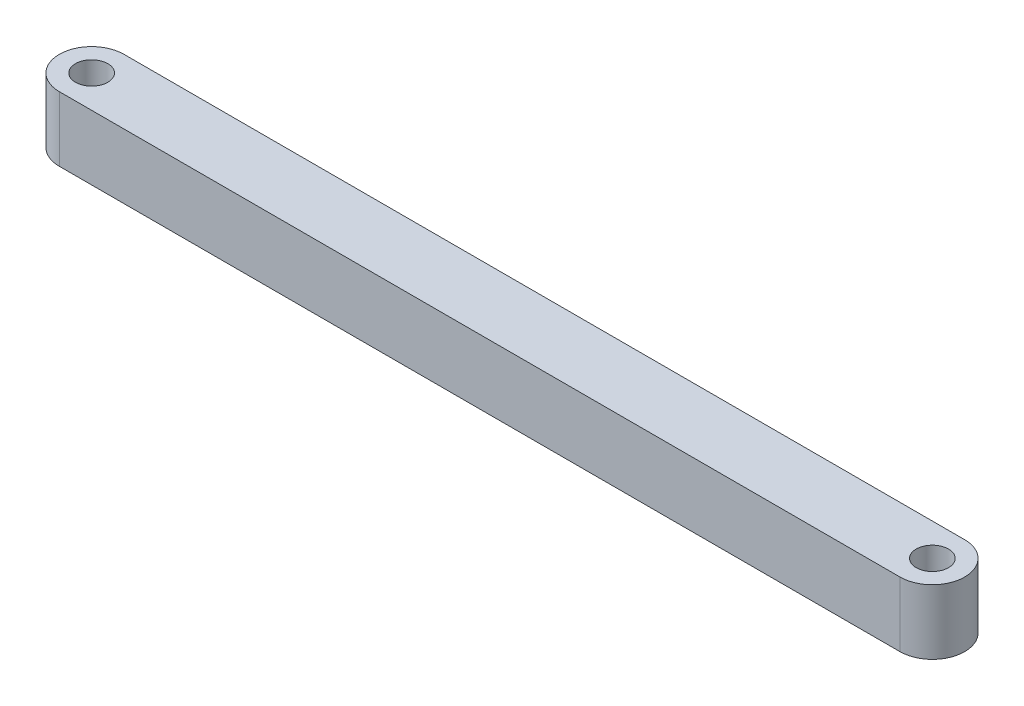
ISO-10303-21;
HEADER;
FILE_DESCRIPTION(('STEP AP214'),'2;1');
FILE_NAME('part.step','',(''),(''),'','','');
FILE_SCHEMA(('AUTOMOTIVE_DESIGN { 1 0 10303 214 1 1 1 1 }'));
ENDSEC;
DATA;
#1=APPLICATION_CONTEXT('core data for automotive mechanical design processes');
#2=APPLICATION_PROTOCOL_DEFINITION('international standard','automotive_design',2000,#1);
#3=PRODUCT_CONTEXT('',#1,'mechanical');
#4=PRODUCT('Part','Part','',(#3));
#5=PRODUCT_RELATED_PRODUCT_CATEGORY('part','',(#4));
#6=PRODUCT_DEFINITION_FORMATION('','',#4);
#7=PRODUCT_DEFINITION_CONTEXT('part definition',#1,'design');
#8=PRODUCT_DEFINITION('design','',#6,#7);
#9=PRODUCT_DEFINITION_SHAPE('','',#8);
#10=(LENGTH_UNIT() NAMED_UNIT(*) SI_UNIT(.MILLI.,.METRE.));
#11=(NAMED_UNIT(*) PLANE_ANGLE_UNIT() SI_UNIT($,.RADIAN.));
#12=(NAMED_UNIT(*) SI_UNIT($,.STERADIAN.) SOLID_ANGLE_UNIT());
#13=UNCERTAINTY_MEASURE_WITH_UNIT(LENGTH_MEASURE(1.E-05),#10,'distance_accuracy_value','');
#14=(GEOMETRIC_REPRESENTATION_CONTEXT(3) GLOBAL_UNCERTAINTY_ASSIGNED_CONTEXT((#13)) GLOBAL_UNIT_ASSIGNED_CONTEXT((#10,
#11,#12)) REPRESENTATION_CONTEXT('',''));
#15=CARTESIAN_POINT('',(0.,0.,0.));
#16=DIRECTION('',(0.,0.,1.));
#17=DIRECTION('',(1.,0.,0.));
#18=AXIS2_PLACEMENT_3D('',#15,#16,#17);
#19=CARTESIAN_POINT('',(-65.,10.,0.));
#20=DIRECTION('',(0.,-1.,0.));
#21=DIRECTION('',(0.,0.,-1.));
#22=AXIS2_PLACEMENT_3D('',#19,#20,#21);
#23=PLANE('',#22);
#24=CARTESIAN_POINT('',(-65.,10.,0.));
#25=DIRECTION('',(0.,1.,0.));
#26=DIRECTION('',(0.,0.,1.));
#27=AXIS2_PLACEMENT_3D('',#24,#25,#26);
#28=CIRCLE('',#27,2.5);
#29=CARTESIAN_POINT('',(-65.,10.,2.5));
#30=VERTEX_POINT('',#29);
#31=EDGE_CURVE('E103',#30,#30,#28,.T.);
#32=ORIENTED_EDGE('',*,*,#31,.F.);
#33=EDGE_LOOP('',(#32));
#34=FACE_BOUND('',#33,.T.);
#35=CARTESIAN_POINT('',(-65.,10.,0.));
#36=DIRECTION('',(0.,1.,0.));
#37=DIRECTION('',(0.,0.,-1.));
#38=AXIS2_PLACEMENT_3D('',#35,#36,#37);
#39=CIRCLE('',#38,5.);
#40=CARTESIAN_POINT('',(-65.,10.,-4.99999999999999));
#41=VERTEX_POINT('',#40);
#42=CARTESIAN_POINT('',(-65.,10.,5.00000000000001));
#43=VERTEX_POINT('',#42);
#44=EDGE_CURVE('E88',#41,#43,#39,.T.);
#45=ORIENTED_EDGE('',*,*,#44,.T.);
#46=DIRECTION('',(1.,0.,0.));
#47=VECTOR('',#46,1.);
#48=CARTESIAN_POINT('',(-65.,10.,5.00000000000001));
#49=LINE('',#48,#47);
#50=CARTESIAN_POINT('',(65.,10.,4.99999999999998));
#51=VERTEX_POINT('',#50);
#52=EDGE_CURVE('E83',#43,#51,#49,.T.);
#53=ORIENTED_EDGE('',*,*,#52,.T.);
#54=CARTESIAN_POINT('',(65.,10.,0.));
#55=DIRECTION('',(0.,1.,0.));
#56=DIRECTION('',(0.,0.,1.));
#57=AXIS2_PLACEMENT_3D('',#54,#55,#56);
#58=CIRCLE('',#57,4.99999999999999);
#59=CARTESIAN_POINT('',(65.,10.,-4.99999999999999));
#60=VERTEX_POINT('',#59);
#61=EDGE_CURVE('E86',#51,#60,#58,.T.);
#62=ORIENTED_EDGE('',*,*,#61,.T.);
#63=DIRECTION('',(-1.,0.,0.));
#64=VECTOR('',#63,1.);
#65=CARTESIAN_POINT('',(-65.,10.,-4.99999999999999));
#66=LINE('',#65,#64);
#67=EDGE_CURVE('E53',#60,#41,#66,.T.);
#68=ORIENTED_EDGE('',*,*,#67,.T.);
#69=EDGE_LOOP('',(#45,#53,#62,#68));
#70=FACE_BOUND('',#69,.T.);
#71=CARTESIAN_POINT('',(65.,10.,0.));
#72=DIRECTION('',(0.,1.,0.));
#73=DIRECTION('',(0.,0.,1.));
#74=AXIS2_PLACEMENT_3D('',#71,#72,#73);
#75=CIRCLE('',#74,2.5);
#76=CARTESIAN_POINT('',(65.,10.,2.5));
#77=VERTEX_POINT('',#76);
#78=EDGE_CURVE('E118',#77,#77,#75,.T.);
#79=ORIENTED_EDGE('',*,*,#78,.F.);
#80=EDGE_LOOP('',(#79));
#81=FACE_BOUND('',#80,.T.);
#82=ADVANCED_FACE('F36',(#34,#70,#81),#23,.F.);
#83=CARTESIAN_POINT('',(-65.,0.,0.));
#84=DIRECTION('',(0.,-1.,0.));
#85=DIRECTION('',(0.,0.,-1.));
#86=AXIS2_PLACEMENT_3D('',#83,#84,#85);
#87=PLANE('',#86);
#88=CARTESIAN_POINT('',(-65.,0.,0.));
#89=DIRECTION('',(0.,1.,0.));
#90=DIRECTION('',(0.,0.,1.));
#91=AXIS2_PLACEMENT_3D('',#88,#89,#90);
#92=CIRCLE('',#91,2.5);
#93=CARTESIAN_POINT('',(-65.,0.,2.5));
#94=VERTEX_POINT('',#93);
#95=EDGE_CURVE('E115',#94,#94,#92,.T.);
#96=ORIENTED_EDGE('',*,*,#95,.T.);
#97=EDGE_LOOP('',(#96));
#98=FACE_BOUND('',#97,.T.);
#99=CARTESIAN_POINT('',(-65.,0.,0.));
#100=DIRECTION('',(0.,1.,0.));
#101=DIRECTION('',(0.,0.,-1.));
#102=AXIS2_PLACEMENT_3D('',#99,#100,#101);
#103=CIRCLE('',#102,5.);
#104=CARTESIAN_POINT('',(-65.,0.,-4.99999999999999));
#105=VERTEX_POINT('',#104);
#106=CARTESIAN_POINT('',(-65.,0.,5.00000000000001));
#107=VERTEX_POINT('',#106);
#108=EDGE_CURVE('E100',#105,#107,#103,.T.);
#109=ORIENTED_EDGE('',*,*,#108,.F.);
#110=DIRECTION('',(-1.,0.,0.));
#111=VECTOR('',#110,1.);
#112=CARTESIAN_POINT('',(-65.,0.,-4.99999999999999));
#113=LINE('',#112,#111);
#114=CARTESIAN_POINT('',(65.,0.,-4.99999999999999));
#115=VERTEX_POINT('',#114);
#116=EDGE_CURVE('E76',#115,#105,#113,.T.);
#117=ORIENTED_EDGE('',*,*,#116,.F.);
#118=CARTESIAN_POINT('',(65.,0.,0.));
#119=DIRECTION('',(0.,1.,0.));
#120=DIRECTION('',(0.,0.,1.));
#121=AXIS2_PLACEMENT_3D('',#118,#119,#120);
#122=CIRCLE('',#121,4.99999999999999);
#123=CARTESIAN_POINT('',(65.,0.,4.99999999999998));
#124=VERTEX_POINT('',#123);
#125=EDGE_CURVE('E70',#124,#115,#122,.T.);
#126=ORIENTED_EDGE('',*,*,#125,.F.);
#127=DIRECTION('',(1.,0.,0.));
#128=VECTOR('',#127,1.);
#129=CARTESIAN_POINT('',(-65.,0.,5.00000000000001));
#130=LINE('',#129,#128);
#131=EDGE_CURVE('E92',#107,#124,#130,.T.);
#132=ORIENTED_EDGE('',*,*,#131,.F.);
#133=EDGE_LOOP('',(#109,#117,#126,#132));
#134=FACE_BOUND('',#133,.T.);
#135=CARTESIAN_POINT('',(65.,0.,0.));
#136=DIRECTION('',(0.,1.,0.));
#137=DIRECTION('',(0.,0.,1.));
#138=AXIS2_PLACEMENT_3D('',#135,#136,#137);
#139=CIRCLE('',#138,2.5);
#140=CARTESIAN_POINT('',(65.,0.,2.5));
#141=VERTEX_POINT('',#140);
#142=EDGE_CURVE('E121',#141,#141,#139,.T.);
#143=ORIENTED_EDGE('',*,*,#142,.T.);
#144=EDGE_LOOP('',(#143));
#145=FACE_BOUND('',#144,.T.);
#146=ADVANCED_FACE('F111',(#98,#134,#145),#87,.T.);
#147=CARTESIAN_POINT('',(-65.,10.,0.));
#148=DIRECTION('',(0.,-1.,0.));
#149=DIRECTION('',(0.,0.,-1.));
#150=AXIS2_PLACEMENT_3D('',#147,#148,#149);
#151=CYLINDRICAL_SURFACE('',#150,5.);
#152=ORIENTED_EDGE('',*,*,#108,.T.);
#153=DIRECTION('',(0.,-1.,0.));
#154=VECTOR('',#153,1.);
#155=CARTESIAN_POINT('',(-65.,10.,5.00000000000001));
#156=LINE('',#155,#154);
#157=EDGE_CURVE('E11',#43,#107,#156,.T.);
#158=ORIENTED_EDGE('',*,*,#157,.F.);
#159=ORIENTED_EDGE('',*,*,#44,.F.);
#160=DIRECTION('',(0.,-1.,0.));
#161=VECTOR('',#160,1.);
#162=CARTESIAN_POINT('',(-65.,10.,-4.99999999999999));
#163=LINE('',#162,#161);
#164=EDGE_CURVE('E96',#41,#105,#163,.T.);
#165=ORIENTED_EDGE('',*,*,#164,.T.);
#166=EDGE_LOOP('',(#152,#158,#159,#165));
#167=FACE_BOUND('',#166,.T.);
#168=ADVANCED_FACE('F38',(#167),#151,.T.);
#169=CARTESIAN_POINT('',(-65.,10.,5.00000000000001));
#170=DIRECTION('',(0.,0.,-1.));
#171=DIRECTION('',(-1.,0.,0.));
#172=AXIS2_PLACEMENT_3D('',#169,#170,#171);
#173=PLANE('',#172);
#174=ORIENTED_EDGE('',*,*,#131,.T.);
#175=DIRECTION('',(0.,-1.,0.));
#176=VECTOR('',#175,1.);
#177=CARTESIAN_POINT('',(65.,10.,4.99999999999998));
#178=LINE('',#177,#176);
#179=EDGE_CURVE('E45',#51,#124,#178,.T.);
#180=ORIENTED_EDGE('',*,*,#179,.F.);
#181=ORIENTED_EDGE('',*,*,#52,.F.);
#182=ORIENTED_EDGE('',*,*,#157,.T.);
#183=EDGE_LOOP('',(#174,#180,#181,#182));
#184=FACE_BOUND('',#183,.T.);
#185=ADVANCED_FACE('F91',(#184),#173,.F.);
#186=CARTESIAN_POINT('',(65.,10.,0.));
#187=DIRECTION('',(0.,-1.,0.));
#188=DIRECTION('',(0.,0.,-1.));
#189=AXIS2_PLACEMENT_3D('',#186,#187,#188);
#190=CYLINDRICAL_SURFACE('',#189,4.99999999999999);
#191=ORIENTED_EDGE('',*,*,#125,.T.);
#192=DIRECTION('',(0.,-1.,0.));
#193=VECTOR('',#192,1.);
#194=CARTESIAN_POINT('',(65.,10.,-4.99999999999999));
#195=LINE('',#194,#193);
#196=EDGE_CURVE('E93',#60,#115,#195,.T.);
#197=ORIENTED_EDGE('',*,*,#196,.F.);
#198=ORIENTED_EDGE('',*,*,#61,.F.);
#199=ORIENTED_EDGE('',*,*,#179,.T.);
#200=EDGE_LOOP('',(#191,#197,#198,#199));
#201=FACE_BOUND('',#200,.T.);
#202=ADVANCED_FACE('F94',(#201),#190,.T.);
#203=CARTESIAN_POINT('',(-65.,10.,-4.99999999999999));
#204=DIRECTION('',(0.,0.,1.));
#205=DIRECTION('',(1.,0.,0.));
#206=AXIS2_PLACEMENT_3D('',#203,#204,#205);
#207=PLANE('',#206);
#208=ORIENTED_EDGE('',*,*,#116,.T.);
#209=ORIENTED_EDGE('',*,*,#164,.F.);
#210=ORIENTED_EDGE('',*,*,#67,.F.);
#211=ORIENTED_EDGE('',*,*,#196,.T.);
#212=EDGE_LOOP('',(#208,#209,#210,#211));
#213=FACE_BOUND('',#212,.T.);
#214=ADVANCED_FACE('F108',(#213),#207,.F.);
#215=CARTESIAN_POINT('',(-65.,10.,0.));
#216=DIRECTION('',(0.,-1.,0.));
#217=DIRECTION('',(0.,0.,-1.));
#218=AXIS2_PLACEMENT_3D('',#215,#216,#217);
#219=CYLINDRICAL_SURFACE('',#218,2.5);
#220=ORIENTED_EDGE('',*,*,#31,.T.);
#221=EDGE_LOOP('',(#220));
#222=FACE_BOUND('',#221,.T.);
#223=ORIENTED_EDGE('',*,*,#95,.F.);
#224=EDGE_LOOP('',(#223));
#225=FACE_BOUND('',#224,.T.);
#226=ADVANCED_FACE('F139',(#222,#225),#219,.F.);
#227=CARTESIAN_POINT('',(65.,10.,0.));
#228=DIRECTION('',(0.,-1.,0.));
#229=DIRECTION('',(0.,0.,-1.));
#230=AXIS2_PLACEMENT_3D('',#227,#228,#229);
#231=CYLINDRICAL_SURFACE('',#230,2.5);
#232=ORIENTED_EDGE('',*,*,#78,.T.);
#233=EDGE_LOOP('',(#232));
#234=FACE_BOUND('',#233,.T.);
#235=ORIENTED_EDGE('',*,*,#142,.F.);
#236=EDGE_LOOP('',(#235));
#237=FACE_BOUND('',#236,.T.);
#238=ADVANCED_FACE('F127',(#234,#237),#231,.F.);
#239=CLOSED_SHELL('',(#82,#146,#168,#185,#202,#214,#226,#238));
#240=MANIFOLD_SOLID_BREP('B2',#239);
#241=ADVANCED_BREP_SHAPE_REPRESENTATION('',(#18,#240),#14);
#242=SHAPE_DEFINITION_REPRESENTATION(#9,#241);
ENDSEC;
END-ISO-10303-21;
